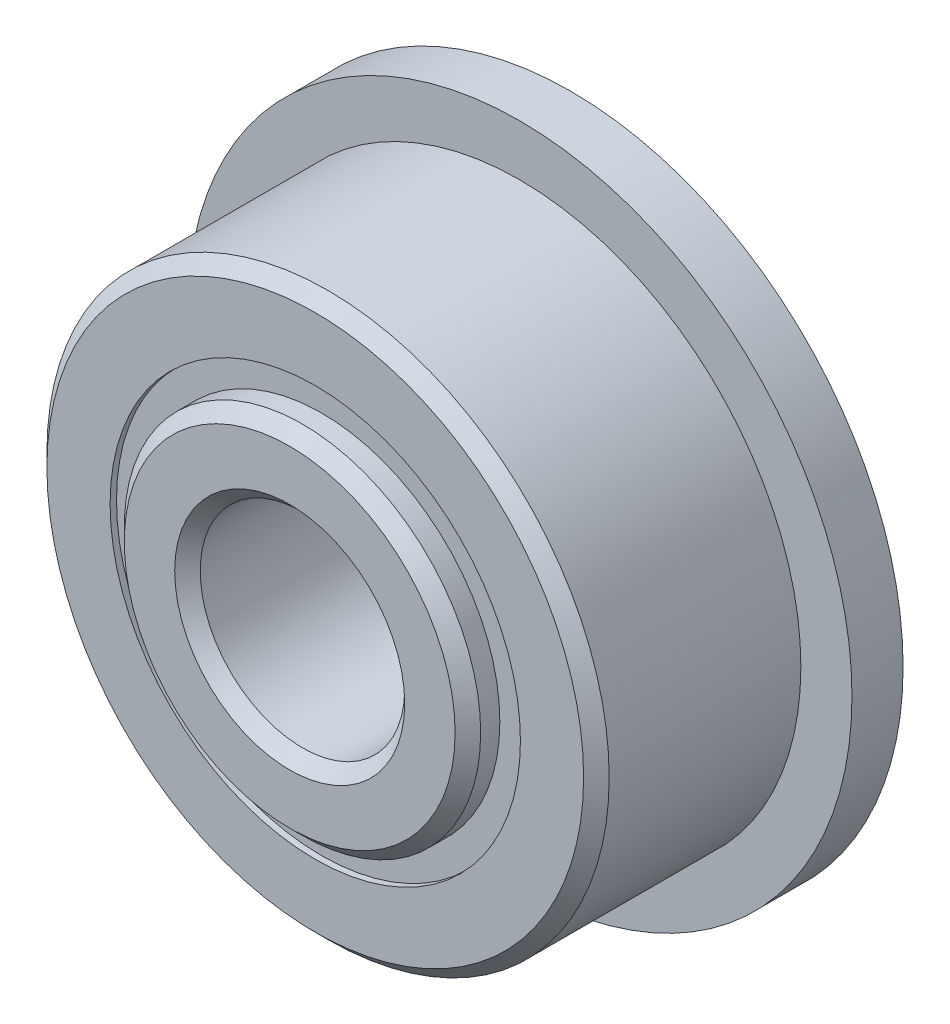
ISO-10303-21;
HEADER;
FILE_DESCRIPTION(('STEP AP214'),'2;1');
FILE_NAME('part.step','',(''),(''),'','','');
FILE_SCHEMA(('AUTOMOTIVE_DESIGN { 1 0 10303 214 1 1 1 1 }'));
ENDSEC;
DATA;
#1=APPLICATION_CONTEXT('core data for automotive mechanical design processes');
#2=APPLICATION_PROTOCOL_DEFINITION('international standard','automotive_design',2000,#1);
#3=PRODUCT_CONTEXT('',#1,'mechanical');
#4=PRODUCT('Part','Part','',(#3));
#5=PRODUCT_RELATED_PRODUCT_CATEGORY('part','',(#4));
#6=PRODUCT_DEFINITION_FORMATION('','',#4);
#7=PRODUCT_DEFINITION_CONTEXT('part definition',#1,'design');
#8=PRODUCT_DEFINITION('design','',#6,#7);
#9=PRODUCT_DEFINITION_SHAPE('','',#8);
#10=(LENGTH_UNIT() NAMED_UNIT(*) SI_UNIT(.MILLI.,.METRE.));
#11=(NAMED_UNIT(*) PLANE_ANGLE_UNIT() SI_UNIT($,.RADIAN.));
#12=(NAMED_UNIT(*) SI_UNIT($,.STERADIAN.) SOLID_ANGLE_UNIT());
#13=UNCERTAINTY_MEASURE_WITH_UNIT(LENGTH_MEASURE(1.E-05),#10,'distance_accuracy_value','');
#14=(GEOMETRIC_REPRESENTATION_CONTEXT(3) GLOBAL_UNCERTAINTY_ASSIGNED_CONTEXT((#13)) GLOBAL_UNIT_ASSIGNED_CONTEXT((#10,
#11,#12)) REPRESENTATION_CONTEXT('',''));
#15=CARTESIAN_POINT('',(0.,0.,0.));
#16=DIRECTION('',(0.,0.,1.));
#17=DIRECTION('',(1.,0.,0.));
#18=AXIS2_PLACEMENT_3D('',#15,#16,#17);
#19=CARTESIAN_POINT('',(0.,6.37180631868132,-3.7703125));
#20=DIRECTION('',(0.,0.,1.));
#21=DIRECTION('',(1.,0.,0.));
#22=AXIS2_PLACEMENT_3D('',#19,#20,#21);
#23=PLANE('',#22);
#24=CARTESIAN_POINT('',(0.,0.,-3.7703125));
#25=DIRECTION('',(0.,0.,1.));
#26=DIRECTION('',(1.,0.,0.));
#27=AXIS2_PLACEMENT_3D('',#24,#25,#26);
#28=CIRCLE('',#27,6.37180631868132);
#29=CARTESIAN_POINT('',(6.37180631868132,0.,-3.7703125));
#30=VERTEX_POINT('',#29);
#31=EDGE_CURVE('E57',#30,#30,#28,.T.);
#32=ORIENTED_EDGE('',*,*,#31,.F.);
#33=EDGE_LOOP('',(#32));
#34=FACE_BOUND('',#33,.T.);
#35=CARTESIAN_POINT('',(0.,0.,-3.7703125));
#36=DIRECTION('',(0.,0.,1.));
#37=DIRECTION('',(1.,0.,0.));
#38=AXIS2_PLACEMENT_3D('',#35,#36,#37);
#39=CIRCLE('',#38,5.53444368131868);
#40=CARTESIAN_POINT('',(5.53444368131868,0.,-3.7703125));
#41=VERTEX_POINT('',#40);
#42=EDGE_CURVE('E11',#41,#41,#39,.T.);
#43=ORIENTED_EDGE('',*,*,#42,.T.);
#44=EDGE_LOOP('',(#43));
#45=FACE_BOUND('',#44,.T.);
#46=ADVANCED_FACE('F43',(#34,#45),#23,.F.);
#47=CARTESIAN_POINT('',(0.,0.,3.96875));
#48=DIRECTION('',(0.,0.,1.));
#49=DIRECTION('',(1.,0.,0.));
#50=AXIS2_PLACEMENT_3D('',#47,#48,#49);
#51=CYLINDRICAL_SURFACE('',#50,5.53444368131868);
#52=ORIENTED_EDGE('',*,*,#42,.F.);
#53=EDGE_LOOP('',(#52));
#54=FACE_BOUND('',#53,.T.);
#55=CARTESIAN_POINT('',(0.,0.,-1.81289769677122));
#56=DIRECTION('',(0.,0.,1.));
#57=DIRECTION('',(1.,0.,0.));
#58=AXIS2_PLACEMENT_3D('',#55,#56,#57);
#59=CIRCLE('',#58,5.53444368131868);
#60=CARTESIAN_POINT('',(5.53444368131868,0.,-1.81289769677122));
#61=VERTEX_POINT('',#60);
#62=EDGE_CURVE('E49',#61,#61,#59,.T.);
#63=ORIENTED_EDGE('',*,*,#62,.T.);
#64=EDGE_LOOP('',(#63));
#65=FACE_BOUND('',#64,.T.);
#66=ADVANCED_FACE('F66',(#54,#65),#51,.F.);
#67=CARTESIAN_POINT('',(0.,6.37180631868132,-1.81289769677122));
#68=DIRECTION('',(0.,0.,-1.));
#69=DIRECTION('',(-1.,0.,0.));
#70=AXIS2_PLACEMENT_3D('',#67,#68,#69);
#71=PLANE('',#70);
#72=ORIENTED_EDGE('',*,*,#62,.F.);
#73=EDGE_LOOP('',(#72));
#74=FACE_BOUND('',#73,.T.);
#75=CARTESIAN_POINT('',(0.,0.,-1.81289769677122));
#76=DIRECTION('',(0.,0.,1.));
#77=DIRECTION('',(1.,0.,0.));
#78=AXIS2_PLACEMENT_3D('',#75,#76,#77);
#79=CIRCLE('',#78,6.37180631868132);
#80=CARTESIAN_POINT('',(6.37180631868132,0.,-1.81289769677122));
#81=VERTEX_POINT('',#80);
#82=EDGE_CURVE('E53',#81,#81,#79,.T.);
#83=ORIENTED_EDGE('',*,*,#82,.T.);
#84=EDGE_LOOP('',(#83));
#85=FACE_BOUND('',#84,.T.);
#86=ADVANCED_FACE('F70',(#74,#85),#71,.F.);
#87=CARTESIAN_POINT('',(0.,0.,3.96875));
#88=DIRECTION('',(0.,0.,1.));
#89=DIRECTION('',(1.,0.,0.));
#90=AXIS2_PLACEMENT_3D('',#87,#88,#89);
#91=CYLINDRICAL_SURFACE('',#90,6.37180631868132);
#92=ORIENTED_EDGE('',*,*,#82,.F.);
#93=EDGE_LOOP('',(#92));
#94=FACE_BOUND('',#93,.T.);
#95=ORIENTED_EDGE('',*,*,#31,.T.);
#96=EDGE_LOOP('',(#95));
#97=FACE_BOUND('',#96,.T.);
#98=ADVANCED_FACE('F63',(#94,#97),#91,.T.);
#99=CLOSED_SHELL('',(#46,#66,#86,#98));
#100=MANIFOLD_SOLID_BREP('B2',#99);
#101=CARTESIAN_POINT('',(0.,6.37180631868132,3.7703125));
#102=DIRECTION('',(0.,0.,-1.));
#103=DIRECTION('',(-1.,0.,0.));
#104=AXIS2_PLACEMENT_3D('',#101,#102,#103);
#105=PLANE('',#104);
#106=CARTESIAN_POINT('',(0.,0.,3.7703125));
#107=DIRECTION('',(0.,0.,1.));
#108=DIRECTION('',(1.,0.,0.));
#109=AXIS2_PLACEMENT_3D('',#106,#107,#108);
#110=CIRCLE('',#109,5.53444368131868);
#111=CARTESIAN_POINT('',(5.53444368131868,0.,3.7703125));
#112=VERTEX_POINT('',#111);
#113=EDGE_CURVE('E42',#112,#112,#110,.T.);
#114=ORIENTED_EDGE('',*,*,#113,.F.);
#115=EDGE_LOOP('',(#114));
#116=FACE_BOUND('',#115,.T.);
#117=CARTESIAN_POINT('',(0.,0.,3.7703125));
#118=DIRECTION('',(0.,0.,1.));
#119=DIRECTION('',(1.,0.,0.));
#120=AXIS2_PLACEMENT_3D('',#117,#118,#119);
#121=CIRCLE('',#120,6.37180631868132);
#122=CARTESIAN_POINT('',(6.37180631868132,0.,3.7703125));
#123=VERTEX_POINT('',#122);
#124=EDGE_CURVE('E124',#123,#123,#121,.T.);
#125=ORIENTED_EDGE('',*,*,#124,.T.);
#126=EDGE_LOOP('',(#125));
#127=FACE_BOUND('',#126,.T.);
#128=ADVANCED_FACE('F110',(#116,#127),#105,.F.);
#129=CARTESIAN_POINT('',(0.,0.,3.96875));
#130=DIRECTION('',(0.,0.,1.));
#131=DIRECTION('',(1.,0.,0.));
#132=AXIS2_PLACEMENT_3D('',#129,#130,#131);
#133=CYLINDRICAL_SURFACE('',#132,5.53444368131868);
#134=CARTESIAN_POINT('',(0.,0.,1.81289769677122));
#135=DIRECTION('',(0.,0.,1.));
#136=DIRECTION('',(1.,0.,0.));
#137=AXIS2_PLACEMENT_3D('',#134,#135,#136);
#138=CIRCLE('',#137,5.53444368131868);
#139=CARTESIAN_POINT('',(5.53444368131868,0.,1.81289769677122));
#140=VERTEX_POINT('',#139);
#141=EDGE_CURVE('E116',#140,#140,#138,.T.);
#142=ORIENTED_EDGE('',*,*,#141,.F.);
#143=EDGE_LOOP('',(#142));
#144=FACE_BOUND('',#143,.T.);
#145=ORIENTED_EDGE('',*,*,#113,.T.);
#146=EDGE_LOOP('',(#145));
#147=FACE_BOUND('',#146,.T.);
#148=ADVANCED_FACE('F139',(#144,#147),#133,.F.);
#149=CARTESIAN_POINT('',(0.,6.37180631868132,1.81289769677122));
#150=DIRECTION('',(0.,0.,1.));
#151=DIRECTION('',(1.,0.,0.));
#152=AXIS2_PLACEMENT_3D('',#149,#150,#151);
#153=PLANE('',#152);
#154=CARTESIAN_POINT('',(0.,0.,1.81289769677122));
#155=DIRECTION('',(0.,0.,1.));
#156=DIRECTION('',(1.,0.,0.));
#157=AXIS2_PLACEMENT_3D('',#154,#155,#156);
#158=CIRCLE('',#157,6.37180631868132);
#159=CARTESIAN_POINT('',(6.37180631868132,0.,1.81289769677122));
#160=VERTEX_POINT('',#159);
#161=EDGE_CURVE('E120',#160,#160,#158,.T.);
#162=ORIENTED_EDGE('',*,*,#161,.F.);
#163=EDGE_LOOP('',(#162));
#164=FACE_BOUND('',#163,.T.);
#165=ORIENTED_EDGE('',*,*,#141,.T.);
#166=EDGE_LOOP('',(#165));
#167=FACE_BOUND('',#166,.T.);
#168=ADVANCED_FACE('F134',(#164,#167),#153,.F.);
#169=CARTESIAN_POINT('',(0.,0.,3.96875));
#170=DIRECTION('',(0.,0.,1.));
#171=DIRECTION('',(1.,0.,0.));
#172=AXIS2_PLACEMENT_3D('',#169,#170,#171);
#173=CYLINDRICAL_SURFACE('',#172,6.37180631868132);
#174=ORIENTED_EDGE('',*,*,#124,.F.);
#175=EDGE_LOOP('',(#174));
#176=FACE_BOUND('',#175,.T.);
#177=ORIENTED_EDGE('',*,*,#161,.T.);
#178=EDGE_LOOP('',(#177));
#179=FACE_BOUND('',#178,.T.);
#180=ADVANCED_FACE('F131',(#176,#179),#173,.T.);
#181=CLOSED_SHELL('',(#128,#148,#168,#180));
#182=MANIFOLD_SOLID_BREP('B6',#181);
#183=CARTESIAN_POINT('',(-3.49915908005357,4.81617929463841,0.));
#184=DIRECTION('',(0.,0.,1.));
#185=DIRECTION('',(-0.587785252292462,0.809016994374955,0.));
#186=AXIS2_PLACEMENT_3D('',#183,#184,#185);
#187=SPHERICAL_SURFACE('',#186,1.81289769677122);
#188=CARTESIAN_POINT('',(-3.49915908005357,4.81617929463841,1.81289769677122));
#189=VERTEX_POINT('',#188);
#190=VERTEX_LOOP('',#189);
#191=FACE_BOUND('',#190,.T.);
#192=ADVANCED_FACE('F177',(#191),#187,.T.);
#193=CLOSED_SHELL('',(#192));
#194=MANIFOLD_SOLID_BREP('B37',#193);
#195=CARTESIAN_POINT('',(-5.66175832356957,1.83961679463842,0.));
#196=DIRECTION('',(0.,0.,1.));
#197=DIRECTION('',(-0.95105651629515,0.309016994374958,0.));
#198=AXIS2_PLACEMENT_3D('',#195,#196,#197);
#199=SPHERICAL_SURFACE('',#198,1.81289769677122);
#200=CARTESIAN_POINT('',(-5.66175832356957,1.83961679463842,1.81289769677122));
#201=VERTEX_POINT('',#200);
#202=VERTEX_LOOP('',#201);
#203=FACE_BOUND('',#202,.T.);
#204=ADVANCED_FACE('F197',(#203),#199,.T.);
#205=CLOSED_SHELL('',(#204));
#206=MANIFOLD_SOLID_BREP('B106',#205);
#207=CARTESIAN_POINT('',(-5.6617583235696,-1.8396167946383,0.));
#208=DIRECTION('',(0.,0.,1.));
#209=DIRECTION('',(-0.951056516295157,-0.309016994374938,0.));
#210=AXIS2_PLACEMENT_3D('',#207,#208,#209);
#211=SPHERICAL_SURFACE('',#210,1.81289769677122);
#212=CARTESIAN_POINT('',(-5.6617583235696,-1.8396167946383,1.81289769677122));
#213=VERTEX_POINT('',#212);
#214=VERTEX_LOOP('',#213);
#215=FACE_BOUND('',#214,.T.);
#216=ADVANCED_FACE('F217',(#215),#211,.T.);
#217=CLOSED_SHELL('',(#216));
#218=MANIFOLD_SOLID_BREP('B173',#217);
#219=CARTESIAN_POINT('',(-3.49915908005367,-4.81617929463833,0.));
#220=DIRECTION('',(0.,0.,1.));
#221=DIRECTION('',(-0.58778525229248,-0.809016994374942,0.));
#222=AXIS2_PLACEMENT_3D('',#219,#220,#221);
#223=SPHERICAL_SURFACE('',#222,1.81289769677122);
#224=CARTESIAN_POINT('',(-3.49915908005367,-4.81617929463833,1.81289769677122));
#225=VERTEX_POINT('',#224);
#226=VERTEX_LOOP('',#225);
#227=FACE_BOUND('',#226,.T.);
#228=ADVANCED_FACE('F237',(#227),#223,.T.);
#229=CLOSED_SHELL('',(#228));
#230=MANIFOLD_SOLID_BREP('B193',#229);
#231=CARTESIAN_POINT('',(0.,-5.953125,0.));
#232=DIRECTION('',(0.,0.,1.));
#233=DIRECTION('',(0.,-1.,0.));
#234=AXIS2_PLACEMENT_3D('',#231,#232,#233);
#235=SPHERICAL_SURFACE('',#234,1.81289769677122);
#236=CARTESIAN_POINT('',(0.,-5.953125,1.81289769677122));
#237=VERTEX_POINT('',#236);
#238=VERTEX_LOOP('',#237);
#239=FACE_BOUND('',#238,.T.);
#240=ADVANCED_FACE('F257',(#239),#235,.T.);
#241=CLOSED_SHELL('',(#240));
#242=MANIFOLD_SOLID_BREP('B213',#241);
#243=CARTESIAN_POINT('',(3.4991590800536,-4.81617929463838,0.));
#244=DIRECTION('',(0.,0.,1.));
#245=DIRECTION('',(0.587785252292469,-0.809016994374951,0.));
#246=AXIS2_PLACEMENT_3D('',#243,#244,#245);
#247=SPHERICAL_SURFACE('',#246,1.81289769677122);
#248=CARTESIAN_POINT('',(3.4991590800536,-4.81617929463838,1.81289769677122));
#249=VERTEX_POINT('',#248);
#250=VERTEX_LOOP('',#249);
#251=FACE_BOUND('',#250,.T.);
#252=ADVANCED_FACE('F277',(#251),#247,.T.);
#253=CLOSED_SHELL('',(#252));
#254=MANIFOLD_SOLID_BREP('B233',#253);
#255=CARTESIAN_POINT('',(5.66175832356958,-1.83961679463838,0.));
#256=DIRECTION('',(0.,0.,1.));
#257=DIRECTION('',(0.951056516295152,-0.309016994374952,0.));
#258=AXIS2_PLACEMENT_3D('',#255,#256,#257);
#259=SPHERICAL_SURFACE('',#258,1.81289769677122);
#260=CARTESIAN_POINT('',(5.66175832356958,-1.83961679463838,1.81289769677122));
#261=VERTEX_POINT('',#260);
#262=VERTEX_LOOP('',#261);
#263=FACE_BOUND('',#262,.T.);
#264=ADVANCED_FACE('F297',(#263),#259,.T.);
#265=CLOSED_SHELL('',(#264));
#266=MANIFOLD_SOLID_BREP('B253',#265);
#267=CARTESIAN_POINT('',(5.66175832356959,1.83961679463834,0.));
#268=DIRECTION('',(0.,0.,1.));
#269=DIRECTION('',(0.951056516295155,0.309016994374945,0.));
#270=AXIS2_PLACEMENT_3D('',#267,#268,#269);
#271=SPHERICAL_SURFACE('',#270,1.81289769677122);
#272=CARTESIAN_POINT('',(5.66175832356959,1.83961679463834,1.81289769677122));
#273=VERTEX_POINT('',#272);
#274=VERTEX_LOOP('',#273);
#275=FACE_BOUND('',#274,.T.);
#276=ADVANCED_FACE('F317',(#275),#271,.T.);
#277=CLOSED_SHELL('',(#276));
#278=MANIFOLD_SOLID_BREP('B273',#277);
#279=CARTESIAN_POINT('',(3.49915908005364,4.81617929463835,0.));
#280=DIRECTION('',(0.,0.,1.));
#281=DIRECTION('',(0.587785252292474,0.809016994374947,0.));
#282=AXIS2_PLACEMENT_3D('',#279,#280,#281);
#283=SPHERICAL_SURFACE('',#282,1.81289769677122);
#284=CARTESIAN_POINT('',(3.49915908005364,4.81617929463835,1.81289769677122));
#285=VERTEX_POINT('',#284);
#286=VERTEX_LOOP('',#285);
#287=FACE_BOUND('',#286,.T.);
#288=ADVANCED_FACE('F337',(#287),#283,.T.);
#289=CLOSED_SHELL('',(#288));
#290=MANIFOLD_SOLID_BREP('B293',#289);
#291=CARTESIAN_POINT('',(0.,5.953125,0.));
#292=DIRECTION('',(0.,0.,1.));
#293=DIRECTION('',(0.,1.,0.));
#294=AXIS2_PLACEMENT_3D('',#291,#292,#293);
#295=SPHERICAL_SURFACE('',#294,1.81289769677122);
#296=CARTESIAN_POINT('',(0.,5.953125,1.81289769677122));
#297=VERTEX_POINT('',#296);
#298=VERTEX_LOOP('',#297);
#299=FACE_BOUND('',#298,.T.);
#300=ADVANCED_FACE('F359',(#299),#295,.T.);
#301=CLOSED_SHELL('',(#300));
#302=MANIFOLD_SOLID_BREP('B313',#301);
#303=CARTESIAN_POINT('',(0.,0.,4.365625));
#304=DIRECTION('',(0.,0.,-1.));
#305=DIRECTION('',(-1.,0.,0.));
#306=AXIS2_PLACEMENT_3D('',#303,#304,#305);
#307=CONICAL_SURFACE('',#306,5.53444368131868,0.78539816339745);
#308=CARTESIAN_POINT('',(0.,0.,4.7625));
#309=DIRECTION('',(0.,0.,1.));
#310=DIRECTION('',(1.,0.,0.));
#311=AXIS2_PLACEMENT_3D('',#308,#309,#310);
#312=CIRCLE('',#311,5.13756868131868);
#313=CARTESIAN_POINT('',(5.13756868131868,0.,4.7625));
#314=VERTEX_POINT('',#313);
#315=EDGE_CURVE('E412',#314,#314,#312,.T.);
#316=ORIENTED_EDGE('',*,*,#315,.F.);
#317=EDGE_LOOP('',(#316));
#318=FACE_BOUND('',#317,.T.);
#319=CARTESIAN_POINT('',(0.,0.,4.365625));
#320=DIRECTION('',(0.,0.,1.));
#321=DIRECTION('',(1.,0.,0.));
#322=AXIS2_PLACEMENT_3D('',#319,#320,#321);
#323=CIRCLE('',#322,5.53444368131868);
#324=CARTESIAN_POINT('',(5.53444368131868,0.,4.365625));
#325=VERTEX_POINT('',#324);
#326=EDGE_CURVE('E358',#325,#325,#323,.T.);
#327=ORIENTED_EDGE('',*,*,#326,.T.);
#328=EDGE_LOOP('',(#327));
#329=FACE_BOUND('',#328,.T.);
#330=ADVANCED_FACE('F378',(#318,#329),#307,.T.);
#331=CARTESIAN_POINT('',(0.,0.,3.96875));
#332=DIRECTION('',(0.,0.,1.));
#333=DIRECTION('',(1.,0.,0.));
#334=AXIS2_PLACEMENT_3D('',#331,#332,#333);
#335=CYLINDRICAL_SURFACE('',#334,5.53444368131868);
#336=ORIENTED_EDGE('',*,*,#326,.F.);
#337=EDGE_LOOP('',(#336));
#338=FACE_BOUND('',#337,.T.);
#339=CARTESIAN_POINT('',(0.,0.,1.76388888888889));
#340=DIRECTION('',(0.,0.,1.));
#341=DIRECTION('',(1.,0.,0.));
#342=AXIS2_PLACEMENT_3D('',#339,#340,#341);
#343=CIRCLE('',#342,5.53444368131868);
#344=CARTESIAN_POINT('',(5.53444368131868,0.,1.76388888888889));
#345=VERTEX_POINT('',#344);
#346=EDGE_CURVE('E384',#345,#345,#343,.T.);
#347=ORIENTED_EDGE('',*,*,#346,.T.);
#348=EDGE_LOOP('',(#347));
#349=FACE_BOUND('',#348,.T.);
#350=ADVANCED_FACE('F419',(#338,#349),#335,.T.);
#351=CARTESIAN_POINT('',(0.,0.,0.));
#352=DIRECTION('',(0.,0.,1.));
#353=DIRECTION('',(1.,0.,0.));
#354=AXIS2_PLACEMENT_3D('',#351,#352,#353);
#355=TOROIDAL_SURFACE('',#354,5.95312499999998,1.81289769677122);
#356=ORIENTED_EDGE('',*,*,#346,.F.);
#357=EDGE_LOOP('',(#356));
#358=FACE_BOUND('',#357,.T.);
#359=CARTESIAN_POINT('',(0.,0.,-1.76388888888889));
#360=DIRECTION('',(0.,0.,1.));
#361=DIRECTION('',(1.,0.,0.));
#362=AXIS2_PLACEMENT_3D('',#359,#360,#361);
#363=CIRCLE('',#362,5.53444368131868);
#364=CARTESIAN_POINT('',(5.53444368131868,0.,-1.76388888888889));
#365=VERTEX_POINT('',#364);
#366=EDGE_CURVE('E388',#365,#365,#363,.T.);
#367=ORIENTED_EDGE('',*,*,#366,.T.);
#368=EDGE_LOOP('',(#367));
#369=FACE_BOUND('',#368,.T.);
#370=ADVANCED_FACE('F423',(#358,#369),#355,.F.);
#371=CARTESIAN_POINT('',(0.,0.,3.96875));
#372=DIRECTION('',(0.,0.,1.));
#373=DIRECTION('',(1.,0.,0.));
#374=AXIS2_PLACEMENT_3D('',#371,#372,#373);
#375=CYLINDRICAL_SURFACE('',#374,5.53444368131868);
#376=ORIENTED_EDGE('',*,*,#366,.F.);
#377=EDGE_LOOP('',(#376));
#378=FACE_BOUND('',#377,.T.);
#379=CARTESIAN_POINT('',(0.,0.,-4.365625));
#380=DIRECTION('',(0.,0.,1.));
#381=DIRECTION('',(1.,0.,0.));
#382=AXIS2_PLACEMENT_3D('',#379,#380,#381);
#383=CIRCLE('',#382,5.53444368131868);
#384=CARTESIAN_POINT('',(5.53444368131868,0.,-4.365625));
#385=VERTEX_POINT('',#384);
#386=EDGE_CURVE('E392',#385,#385,#383,.T.);
#387=ORIENTED_EDGE('',*,*,#386,.T.);
#388=EDGE_LOOP('',(#387));
#389=FACE_BOUND('',#388,.T.);
#390=ADVANCED_FACE('F428',(#378,#389),#375,.T.);
#391=CARTESIAN_POINT('',(0.,0.,-4.7625));
#392=DIRECTION('',(0.,0.,1.));
#393=DIRECTION('',(1.,0.,0.));
#394=AXIS2_PLACEMENT_3D('',#391,#392,#393);
#395=CONICAL_SURFACE('',#394,5.13756868131868,0.785398163397454);
#396=ORIENTED_EDGE('',*,*,#386,.F.);
#397=EDGE_LOOP('',(#396));
#398=FACE_BOUND('',#397,.T.);
#399=CARTESIAN_POINT('',(0.,0.,-4.7625));
#400=DIRECTION('',(0.,0.,1.));
#401=DIRECTION('',(1.,0.,0.));
#402=AXIS2_PLACEMENT_3D('',#399,#400,#401);
#403=CIRCLE('',#402,5.13756868131868);
#404=CARTESIAN_POINT('',(5.13756868131868,0.,-4.7625));
#405=VERTEX_POINT('',#404);
#406=EDGE_CURVE('E397',#405,#405,#403,.T.);
#407=ORIENTED_EDGE('',*,*,#406,.T.);
#408=EDGE_LOOP('',(#407));
#409=FACE_BOUND('',#408,.T.);
#410=ADVANCED_FACE('F434',(#398,#409),#395,.T.);
#411=CARTESIAN_POINT('',(0.,5.13756868131868,-4.7625));
#412=DIRECTION('',(0.,0.,1.));
#413=DIRECTION('',(1.,0.,0.));
#414=AXIS2_PLACEMENT_3D('',#411,#412,#413);
#415=PLANE('',#414);
#416=ORIENTED_EDGE('',*,*,#406,.F.);
#417=EDGE_LOOP('',(#416));
#418=FACE_BOUND('',#417,.T.);
#419=CARTESIAN_POINT('',(0.,0.,-4.7625));
#420=DIRECTION('',(0.,0.,1.));
#421=DIRECTION('',(1.,0.,0.));
#422=AXIS2_PLACEMENT_3D('',#419,#420,#421);
#423=CIRCLE('',#422,3.571875);
#424=CARTESIAN_POINT('',(3.571875,0.,-4.7625));
#425=VERTEX_POINT('',#424);
#426=EDGE_CURVE('E400',#425,#425,#423,.T.);
#427=ORIENTED_EDGE('',*,*,#426,.T.);
#428=EDGE_LOOP('',(#427));
#429=FACE_BOUND('',#428,.T.);
#430=ADVANCED_FACE('F438',(#418,#429),#415,.F.);
#431=CARTESIAN_POINT('',(0.,0.,-4.365625));
#432=DIRECTION('',(0.,0.,-1.));
#433=DIRECTION('',(-1.,0.,0.));
#434=AXIS2_PLACEMENT_3D('',#431,#432,#433);
#435=CONICAL_SURFACE('',#434,3.175,0.785398163397448);
#436=ORIENTED_EDGE('',*,*,#426,.F.);
#437=EDGE_LOOP('',(#436));
#438=FACE_BOUND('',#437,.T.);
#439=CARTESIAN_POINT('',(0.,0.,-4.365625));
#440=DIRECTION('',(0.,0.,1.));
#441=DIRECTION('',(1.,0.,0.));
#442=AXIS2_PLACEMENT_3D('',#439,#440,#441);
#443=CIRCLE('',#442,3.175);
#444=CARTESIAN_POINT('',(3.175,0.,-4.365625));
#445=VERTEX_POINT('',#444);
#446=EDGE_CURVE('E403',#445,#445,#443,.T.);
#447=ORIENTED_EDGE('',*,*,#446,.T.);
#448=EDGE_LOOP('',(#447));
#449=FACE_BOUND('',#448,.T.);
#450=ADVANCED_FACE('F442',(#438,#449),#435,.F.);
#451=CARTESIAN_POINT('',(0.,0.,3.96875));
#452=DIRECTION('',(0.,0.,1.));
#453=DIRECTION('',(1.,0.,0.));
#454=AXIS2_PLACEMENT_3D('',#451,#452,#453);
#455=CYLINDRICAL_SURFACE('',#454,3.175);
#456=ORIENTED_EDGE('',*,*,#446,.F.);
#457=EDGE_LOOP('',(#456));
#458=FACE_BOUND('',#457,.T.);
#459=CARTESIAN_POINT('',(0.,0.,4.365625));
#460=DIRECTION('',(0.,0.,1.));
#461=DIRECTION('',(1.,0.,0.));
#462=AXIS2_PLACEMENT_3D('',#459,#460,#461);
#463=CIRCLE('',#462,3.175);
#464=CARTESIAN_POINT('',(3.175,0.,4.365625));
#465=VERTEX_POINT('',#464);
#466=EDGE_CURVE('E406',#465,#465,#463,.T.);
#467=ORIENTED_EDGE('',*,*,#466,.T.);
#468=EDGE_LOOP('',(#467));
#469=FACE_BOUND('',#468,.T.);
#470=ADVANCED_FACE('F446',(#458,#469),#455,.F.);
#471=CARTESIAN_POINT('',(0.,0.,4.7625));
#472=DIRECTION('',(0.,0.,1.));
#473=DIRECTION('',(1.,0.,0.));
#474=AXIS2_PLACEMENT_3D('',#471,#472,#473);
#475=CONICAL_SURFACE('',#474,3.571875,0.785398163397453);
#476=ORIENTED_EDGE('',*,*,#466,.F.);
#477=EDGE_LOOP('',(#476));
#478=FACE_BOUND('',#477,.T.);
#479=CARTESIAN_POINT('',(0.,0.,4.7625));
#480=DIRECTION('',(0.,0.,1.));
#481=DIRECTION('',(1.,0.,0.));
#482=AXIS2_PLACEMENT_3D('',#479,#480,#481);
#483=CIRCLE('',#482,3.571875);
#484=CARTESIAN_POINT('',(3.571875,0.,4.7625));
#485=VERTEX_POINT('',#484);
#486=EDGE_CURVE('E409',#485,#485,#483,.T.);
#487=ORIENTED_EDGE('',*,*,#486,.T.);
#488=EDGE_LOOP('',(#487));
#489=FACE_BOUND('',#488,.T.);
#490=ADVANCED_FACE('F450',(#478,#489),#475,.F.);
#491=CARTESIAN_POINT('',(0.,3.571875,4.7625));
#492=DIRECTION('',(0.,0.,-1.));
#493=DIRECTION('',(-1.,0.,0.));
#494=AXIS2_PLACEMENT_3D('',#491,#492,#493);
#495=PLANE('',#494);
#496=ORIENTED_EDGE('',*,*,#486,.F.);
#497=EDGE_LOOP('',(#496));
#498=FACE_BOUND('',#497,.T.);
#499=ORIENTED_EDGE('',*,*,#315,.T.);
#500=EDGE_LOOP('',(#499));
#501=FACE_BOUND('',#500,.T.);
#502=ADVANCED_FACE('F416',(#498,#501),#495,.F.);
#503=CLOSED_SHELL('',(#330,#350,#370,#390,#410,#430,#450,#470,#490,#502));
#504=MANIFOLD_SOLID_BREP('B333',#503);
#505=CARTESIAN_POINT('',(0.,0.,3.571875));
#506=DIRECTION('',(0.,0.,-1.));
#507=DIRECTION('',(-1.,0.,0.));
#508=AXIS2_PLACEMENT_3D('',#505,#506,#507);
#509=CONICAL_SURFACE('',#508,8.73125,0.785398163397448);
#510=CARTESIAN_POINT('',(0.,0.,3.96875));
#511=DIRECTION('',(0.,0.,1.));
#512=DIRECTION('',(1.,0.,0.));
#513=AXIS2_PLACEMENT_3D('',#510,#511,#512);
#514=CIRCLE('',#513,8.334375);
#515=CARTESIAN_POINT('',(8.334375,0.,3.96875));
#516=VERTEX_POINT('',#515);
#517=EDGE_CURVE('E551',#516,#516,#514,.T.);
#518=ORIENTED_EDGE('',*,*,#517,.F.);
#519=EDGE_LOOP('',(#518));
#520=FACE_BOUND('',#519,.T.);
#521=CARTESIAN_POINT('',(0.,0.,3.571875));
#522=DIRECTION('',(0.,0.,1.));
#523=DIRECTION('',(1.,0.,0.));
#524=AXIS2_PLACEMENT_3D('',#521,#522,#523);
#525=CIRCLE('',#524,8.73125);
#526=CARTESIAN_POINT('',(8.73125,0.,3.571875));
#527=VERTEX_POINT('',#526);
#528=EDGE_CURVE('E377',#527,#527,#525,.T.);
#529=ORIENTED_EDGE('',*,*,#528,.T.);
#530=EDGE_LOOP('',(#529));
#531=FACE_BOUND('',#530,.T.);
#532=ADVANCED_FACE('F529',(#520,#531),#509,.T.);
#533=CARTESIAN_POINT('',(0.,0.,3.96875));
#534=DIRECTION('',(0.,0.,1.));
#535=DIRECTION('',(1.,0.,0.));
#536=AXIS2_PLACEMENT_3D('',#533,#534,#535);
#537=CYLINDRICAL_SURFACE('',#536,8.73125);
#538=CARTESIAN_POINT('',(0.,0.,-2.38125));
#539=DIRECTION('',(0.,0.,1.));
#540=DIRECTION('',(1.,0.,0.));
#541=AXIS2_PLACEMENT_3D('',#538,#539,#540);
#542=CIRCLE('',#541,8.73125);
#543=CARTESIAN_POINT('',(8.73125,0.,-2.38125));
#544=VERTEX_POINT('',#543);
#545=EDGE_CURVE('E554',#544,#544,#542,.T.);
#546=ORIENTED_EDGE('',*,*,#545,.T.);
#547=EDGE_LOOP('',(#546));
#548=FACE_BOUND('',#547,.T.);
#549=ORIENTED_EDGE('',*,*,#528,.F.);
#550=EDGE_LOOP('',(#549));
#551=FACE_BOUND('',#550,.T.);
#552=ADVANCED_FACE('F574',(#548,#551),#537,.T.);
#553=CARTESIAN_POINT('',(0.,8.334375,-3.96875));
#554=DIRECTION('',(0.,0.,1.));
#555=DIRECTION('',(1.,0.,0.));
#556=AXIS2_PLACEMENT_3D('',#553,#554,#555);
#557=PLANE('',#556);
#558=CARTESIAN_POINT('',(0.,0.,-3.96875));
#559=DIRECTION('',(0.,0.,1.));
#560=DIRECTION('',(1.,0.,0.));
#561=AXIS2_PLACEMENT_3D('',#558,#559,#560);
#562=CIRCLE('',#561,6.37180631868132);
#563=CARTESIAN_POINT('',(6.37180631868132,0.,-3.96875));
#564=VERTEX_POINT('',#563);
#565=EDGE_CURVE('E535',#564,#564,#562,.T.);
#566=ORIENTED_EDGE('',*,*,#565,.T.);
#567=EDGE_LOOP('',(#566));
#568=FACE_BOUND('',#567,.T.);
#569=CARTESIAN_POINT('',(0.,0.,-3.96875));
#570=DIRECTION('',(0.,0.,-1.));
#571=DIRECTION('',(-1.,0.,0.));
#572=AXIS2_PLACEMENT_3D('',#569,#570,#571);
#573=CIRCLE('',#572,10.31875);
#574=CARTESIAN_POINT('',(-10.31875,0.,-3.96875));
#575=VERTEX_POINT('',#574);
#576=EDGE_CURVE('E557',#575,#575,#573,.T.);
#577=ORIENTED_EDGE('',*,*,#576,.T.);
#578=EDGE_LOOP('',(#577));
#579=FACE_BOUND('',#578,.T.);
#580=ADVANCED_FACE('F577',(#568,#579),#557,.F.);
#581=CARTESIAN_POINT('',(0.,0.,3.96875));
#582=DIRECTION('',(0.,0.,1.));
#583=DIRECTION('',(1.,0.,0.));
#584=AXIS2_PLACEMENT_3D('',#581,#582,#583);
#585=CYLINDRICAL_SURFACE('',#584,6.37180631868132);
#586=CARTESIAN_POINT('',(0.,0.,-1.76388888888889));
#587=DIRECTION('',(0.,0.,1.));
#588=DIRECTION('',(1.,0.,0.));
#589=AXIS2_PLACEMENT_3D('',#586,#587,#588);
#590=CIRCLE('',#589,6.37180631868132);
#591=CARTESIAN_POINT('',(6.37180631868132,0.,-1.76388888888889));
#592=VERTEX_POINT('',#591);
#593=EDGE_CURVE('E539',#592,#592,#590,.T.);
#594=ORIENTED_EDGE('',*,*,#593,.T.);
#595=EDGE_LOOP('',(#594));
#596=FACE_BOUND('',#595,.T.);
#597=ORIENTED_EDGE('',*,*,#565,.F.);
#598=EDGE_LOOP('',(#597));
#599=FACE_BOUND('',#598,.T.);
#600=ADVANCED_FACE('F582',(#596,#599),#585,.F.);
#601=CARTESIAN_POINT('',(0.,0.,0.));
#602=DIRECTION('',(0.,0.,1.));
#603=DIRECTION('',(1.,0.,0.));
#604=AXIS2_PLACEMENT_3D('',#601,#602,#603);
#605=TOROIDAL_SURFACE('',#604,5.953125,1.81289769677122);
#606=ORIENTED_EDGE('',*,*,#593,.F.);
#607=EDGE_LOOP('',(#606));
#608=FACE_BOUND('',#607,.T.);
#609=CARTESIAN_POINT('',(0.,0.,1.76388888888889));
#610=DIRECTION('',(0.,0.,1.));
#611=DIRECTION('',(1.,0.,0.));
#612=AXIS2_PLACEMENT_3D('',#609,#610,#611);
#613=CIRCLE('',#612,6.37180631868132);
#614=CARTESIAN_POINT('',(6.37180631868132,0.,1.76388888888889));
#615=VERTEX_POINT('',#614);
#616=EDGE_CURVE('E543',#615,#615,#613,.T.);
#617=ORIENTED_EDGE('',*,*,#616,.T.);
#618=EDGE_LOOP('',(#617));
#619=FACE_BOUND('',#618,.T.);
#620=ADVANCED_FACE('F588',(#608,#619),#605,.F.);
#621=CARTESIAN_POINT('',(0.,0.,3.96875));
#622=DIRECTION('',(0.,0.,1.));
#623=DIRECTION('',(1.,0.,0.));
#624=AXIS2_PLACEMENT_3D('',#621,#622,#623);
#625=CYLINDRICAL_SURFACE('',#624,6.37180631868132);
#626=ORIENTED_EDGE('',*,*,#616,.F.);
#627=EDGE_LOOP('',(#626));
#628=FACE_BOUND('',#627,.T.);
#629=CARTESIAN_POINT('',(0.,0.,3.96875));
#630=DIRECTION('',(0.,0.,1.));
#631=DIRECTION('',(1.,0.,0.));
#632=AXIS2_PLACEMENT_3D('',#629,#630,#631);
#633=CIRCLE('',#632,6.37180631868132);
#634=CARTESIAN_POINT('',(6.37180631868132,0.,3.96875));
#635=VERTEX_POINT('',#634);
#636=EDGE_CURVE('E548',#635,#635,#633,.T.);
#637=ORIENTED_EDGE('',*,*,#636,.T.);
#638=EDGE_LOOP('',(#637));
#639=FACE_BOUND('',#638,.T.);
#640=ADVANCED_FACE('F592',(#628,#639),#625,.F.);
#641=CARTESIAN_POINT('',(0.,8.334375,3.96875));
#642=DIRECTION('',(0.,0.,-1.));
#643=DIRECTION('',(-1.,0.,0.));
#644=AXIS2_PLACEMENT_3D('',#641,#642,#643);
#645=PLANE('',#644);
#646=ORIENTED_EDGE('',*,*,#636,.F.);
#647=EDGE_LOOP('',(#646));
#648=FACE_BOUND('',#647,.T.);
#649=ORIENTED_EDGE('',*,*,#517,.T.);
#650=EDGE_LOOP('',(#649));
#651=FACE_BOUND('',#650,.T.);
#652=ADVANCED_FACE('F570',(#648,#651),#645,.F.);
#653=CARTESIAN_POINT('',(0.,6.37180631868132,-2.38125));
#654=DIRECTION('',(0.,0.,1.));
#655=DIRECTION('',(1.,0.,0.));
#656=AXIS2_PLACEMENT_3D('',#653,#654,#655);
#657=PLANE('',#656);
#658=CARTESIAN_POINT('',(0.,0.,-2.38125));
#659=DIRECTION('',(0.,0.,-1.));
#660=DIRECTION('',(-1.,0.,0.));
#661=AXIS2_PLACEMENT_3D('',#658,#659,#660);
#662=CIRCLE('',#661,10.31875);
#663=CARTESIAN_POINT('',(-10.31875,0.,-2.38125));
#664=VERTEX_POINT('',#663);
#665=EDGE_CURVE('E560',#664,#664,#662,.T.);
#666=ORIENTED_EDGE('',*,*,#665,.F.);
#667=EDGE_LOOP('',(#666));
#668=FACE_BOUND('',#667,.T.);
#669=ORIENTED_EDGE('',*,*,#545,.F.);
#670=EDGE_LOOP('',(#669));
#671=FACE_BOUND('',#670,.T.);
#672=ADVANCED_FACE('F567',(#668,#671),#657,.T.);
#673=CARTESIAN_POINT('',(0.,0.,-3.96875));
#674=DIRECTION('',(0.,0.,-1.));
#675=DIRECTION('',(-1.,0.,0.));
#676=AXIS2_PLACEMENT_3D('',#673,#674,#675);
#677=CYLINDRICAL_SURFACE('',#676,10.31875);
#678=ORIENTED_EDGE('',*,*,#665,.T.);
#679=EDGE_LOOP('',(#678));
#680=FACE_BOUND('',#679,.T.);
#681=ORIENTED_EDGE('',*,*,#576,.F.);
#682=EDGE_LOOP('',(#681));
#683=FACE_BOUND('',#682,.T.);
#684=ADVANCED_FACE('F564',(#680,#683),#677,.T.);
#685=CLOSED_SHELL('',(#532,#552,#580,#600,#620,#640,#652,#672,#684));
#686=MANIFOLD_SOLID_BREP('B353',#685);
#687=ADVANCED_BREP_SHAPE_REPRESENTATION('',(#18,#100,#182,#194,#206,#218,#230,#242,#254,#266,
#278,#290,#302,#504,#686),#14);
#688=SHAPE_DEFINITION_REPRESENTATION(#9,#687);
ENDSEC;
END-ISO-10303-21;
